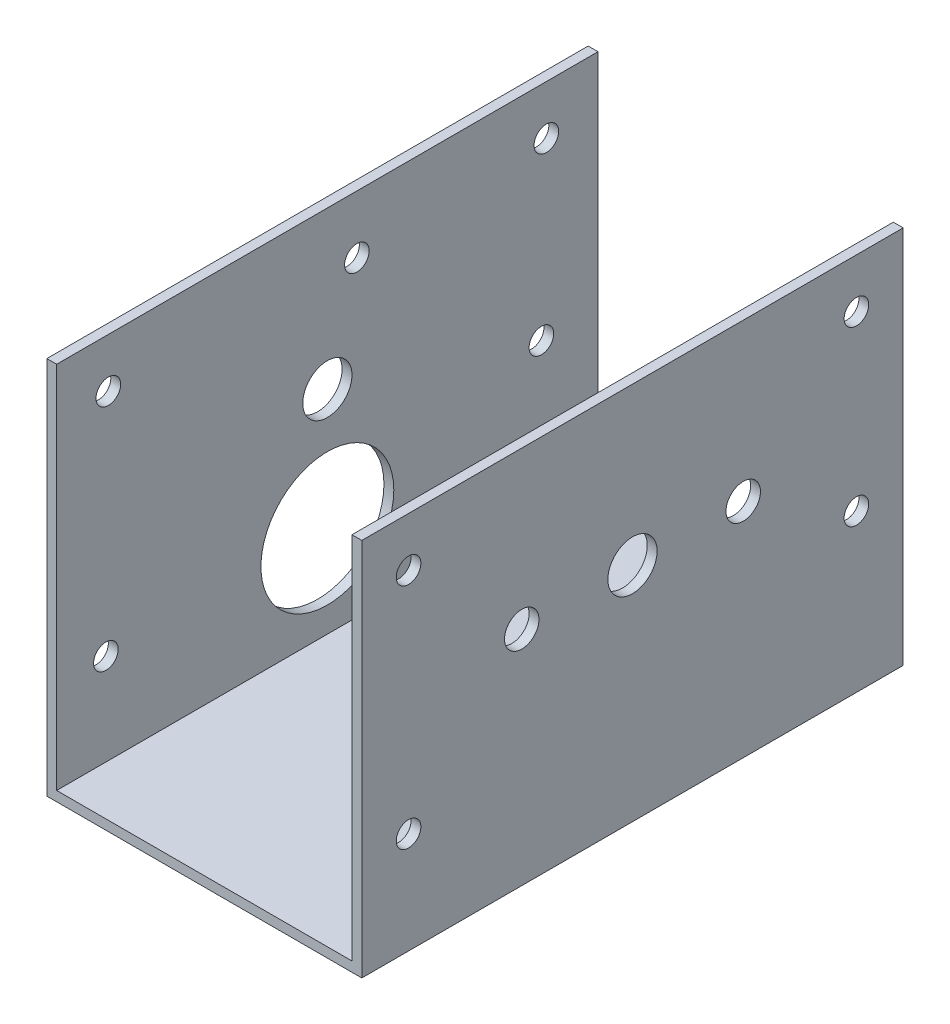
ISO-10303-21;
HEADER;
FILE_DESCRIPTION(('STEP AP214'),'2;1');
FILE_NAME('part.step','',(''),(''),'','','');
FILE_SCHEMA(('AUTOMOTIVE_DESIGN { 1 0 10303 214 1 1 1 1 }'));
ENDSEC;
DATA;
#1=APPLICATION_CONTEXT('core data for automotive mechanical design processes');
#2=APPLICATION_PROTOCOL_DEFINITION('international standard','automotive_design',2000,#1);
#3=PRODUCT_CONTEXT('',#1,'mechanical');
#4=PRODUCT('Part','Part','',(#3));
#5=PRODUCT_RELATED_PRODUCT_CATEGORY('part','',(#4));
#6=PRODUCT_DEFINITION_FORMATION('','',#4);
#7=PRODUCT_DEFINITION_CONTEXT('part definition',#1,'design');
#8=PRODUCT_DEFINITION('design','',#6,#7);
#9=PRODUCT_DEFINITION_SHAPE('','',#8);
#10=(LENGTH_UNIT() NAMED_UNIT(*) SI_UNIT(.MILLI.,.METRE.));
#11=(NAMED_UNIT(*) PLANE_ANGLE_UNIT() SI_UNIT($,.RADIAN.));
#12=(NAMED_UNIT(*) SI_UNIT($,.STERADIAN.) SOLID_ANGLE_UNIT());
#13=UNCERTAINTY_MEASURE_WITH_UNIT(LENGTH_MEASURE(1.E-05),#10,'distance_accuracy_value','');
#14=(GEOMETRIC_REPRESENTATION_CONTEXT(3) GLOBAL_UNCERTAINTY_ASSIGNED_CONTEXT((#13)) GLOBAL_UNIT_ASSIGNED_CONTEXT((#10,
#11,#12)) REPRESENTATION_CONTEXT('',''));
#15=CARTESIAN_POINT('',(0.,0.,0.));
#16=DIRECTION('',(0.,0.,1.));
#17=DIRECTION('',(1.,0.,0.));
#18=AXIS2_PLACEMENT_3D('',#15,#16,#17);
#19=CARTESIAN_POINT('',(0.,0.,0.));
#20=DIRECTION('',(0.,1.,0.));
#21=DIRECTION('',(0.,0.,1.));
#22=AXIS2_PLACEMENT_3D('',#19,#20,#21);
#23=PLANE('',#22);
#24=CARTESIAN_POINT('',(-8.83883476483183,0.,8.83883476483175));
#25=DIRECTION('',(0.,1.,0.));
#26=DIRECTION('',(0.,0.,1.));
#27=AXIS2_PLACEMENT_3D('',#24,#25,#26);
#28=CIRCLE('',#27,2.5);
#29=CARTESIAN_POINT('',(-8.83883476483183,0.,11.3388347648318));
#30=VERTEX_POINT('',#29);
#31=EDGE_CURVE('E303',#30,#30,#28,.T.);
#32=ORIENTED_EDGE('',*,*,#31,.T.);
#33=EDGE_LOOP('',(#32));
#34=FACE_BOUND('',#33,.T.);
#35=CARTESIAN_POINT('',(8.83883476483183,0.,-8.83883476483197));
#36=DIRECTION('',(0.,1.,0.));
#37=DIRECTION('',(0.,0.,1.));
#38=AXIS2_PLACEMENT_3D('',#35,#36,#37);
#39=CIRCLE('',#38,2.5);
#40=CARTESIAN_POINT('',(8.83883476483183,0.,-6.33883476483197));
#41=VERTEX_POINT('',#40);
#42=EDGE_CURVE('E307',#41,#41,#39,.T.);
#43=ORIENTED_EDGE('',*,*,#42,.T.);
#44=EDGE_LOOP('',(#43));
#45=FACE_BOUND('',#44,.T.);
#46=CARTESIAN_POINT('',(8.83883476483183,0.,8.83883476483175));
#47=DIRECTION('',(0.,1.,0.));
#48=DIRECTION('',(0.,0.,1.));
#49=AXIS2_PLACEMENT_3D('',#46,#47,#48);
#50=CIRCLE('',#49,2.5);
#51=CARTESIAN_POINT('',(8.83883476483183,0.,11.3388347648318));
#52=VERTEX_POINT('',#51);
#53=EDGE_CURVE('E311',#52,#52,#50,.T.);
#54=ORIENTED_EDGE('',*,*,#53,.T.);
#55=EDGE_LOOP('',(#54));
#56=FACE_BOUND('',#55,.T.);
#57=CARTESIAN_POINT('',(-8.83883476483183,0.,-8.83883476483197));
#58=DIRECTION('',(0.,1.,0.));
#59=DIRECTION('',(0.,0.,1.));
#60=AXIS2_PLACEMENT_3D('',#57,#58,#59);
#61=CIRCLE('',#60,2.5);
#62=CARTESIAN_POINT('',(-8.83883476483183,0.,-6.33883476483197));
#63=VERTEX_POINT('',#62);
#64=EDGE_CURVE('E315',#63,#63,#61,.T.);
#65=ORIENTED_EDGE('',*,*,#64,.T.);
#66=EDGE_LOOP('',(#65));
#67=FACE_BOUND('',#66,.T.);
#68=DIRECTION('',(-1.,0.,0.));
#69=VECTOR('',#68,1.);
#70=CARTESIAN_POINT('',(0.,0.,55.));
#71=LINE('',#70,#69);
#72=CARTESIAN_POINT('',(32.,0.,55.));
#73=VERTEX_POINT('',#72);
#74=CARTESIAN_POINT('',(-32.,0.,55.));
#75=VERTEX_POINT('',#74);
#76=EDGE_CURVE('E241',#73,#75,#71,.T.);
#77=ORIENTED_EDGE('',*,*,#76,.T.);
#78=DIRECTION('',(0.,0.,1.));
#79=VECTOR('',#78,1.);
#80=CARTESIAN_POINT('',(-32.,0.,-55.));
#81=LINE('',#80,#79);
#82=CARTESIAN_POINT('',(-32.,0.,-55.));
#83=VERTEX_POINT('',#82);
#84=EDGE_CURVE('E214',#83,#75,#81,.T.);
#85=ORIENTED_EDGE('',*,*,#84,.F.);
#86=DIRECTION('',(-1.,0.,0.));
#87=VECTOR('',#86,1.);
#88=CARTESIAN_POINT('',(0.,0.,-55.));
#89=LINE('',#88,#87);
#90=CARTESIAN_POINT('',(32.,0.,-55.));
#91=VERTEX_POINT('',#90);
#92=EDGE_CURVE('E245',#91,#83,#89,.T.);
#93=ORIENTED_EDGE('',*,*,#92,.F.);
#94=DIRECTION('',(0.,0.,1.));
#95=VECTOR('',#94,1.);
#96=CARTESIAN_POINT('',(32.,0.,-55.));
#97=LINE('',#96,#95);
#98=EDGE_CURVE('E185',#91,#73,#97,.T.);
#99=ORIENTED_EDGE('',*,*,#98,.T.);
#100=EDGE_LOOP('',(#77,#85,#93,#99));
#101=FACE_BOUND('',#100,.T.);
#102=ADVANCED_FACE('F97',(#34,#45,#56,#67,#101),#23,.F.);
#103=CARTESIAN_POINT('',(0.,2.,55.));
#104=DIRECTION('',(0.,0.,1.));
#105=DIRECTION('',(1.,0.,0.));
#106=AXIS2_PLACEMENT_3D('',#103,#104,#105);
#107=PLANE('',#106);
#108=ORIENTED_EDGE('',*,*,#76,.F.);
#109=DIRECTION('',(0.,1.,0.));
#110=VECTOR('',#109,1.);
#111=CARTESIAN_POINT('',(32.,0.,55.));
#112=LINE('',#111,#110);
#113=CARTESIAN_POINT('',(32.,77.,55.));
#114=VERTEX_POINT('',#113);
#115=EDGE_CURVE('E192',#73,#114,#112,.T.);
#116=ORIENTED_EDGE('',*,*,#115,.T.);
#117=DIRECTION('',(-1.,0.,0.));
#118=VECTOR('',#117,1.);
#119=CARTESIAN_POINT('',(32.,77.,55.));
#120=LINE('',#119,#118);
#121=CARTESIAN_POINT('',(30.,77.,55.));
#122=VERTEX_POINT('',#121);
#123=EDGE_CURVE('E176',#114,#122,#120,.T.);
#124=ORIENTED_EDGE('',*,*,#123,.T.);
#125=DIRECTION('',(0.,1.,0.));
#126=VECTOR('',#125,1.);
#127=CARTESIAN_POINT('',(30.,0.,55.));
#128=LINE('',#127,#126);
#129=CARTESIAN_POINT('',(30.,2.,55.));
#130=VERTEX_POINT('',#129);
#131=EDGE_CURVE('E187',#130,#122,#128,.T.);
#132=ORIENTED_EDGE('',*,*,#131,.F.);
#133=DIRECTION('',(-1.,0.,0.));
#134=VECTOR('',#133,1.);
#135=CARTESIAN_POINT('',(0.,2.,55.));
#136=LINE('',#135,#134);
#137=CARTESIAN_POINT('',(-30.,2.,55.));
#138=VERTEX_POINT('',#137);
#139=EDGE_CURVE('E244',#130,#138,#136,.T.);
#140=ORIENTED_EDGE('',*,*,#139,.T.);
#141=DIRECTION('',(0.,1.,0.));
#142=VECTOR('',#141,1.);
#143=CARTESIAN_POINT('',(-30.,0.,55.));
#144=LINE('',#143,#142);
#145=CARTESIAN_POINT('',(-30.,77.,55.));
#146=VERTEX_POINT('',#145);
#147=EDGE_CURVE('E229',#138,#146,#144,.T.);
#148=ORIENTED_EDGE('',*,*,#147,.T.);
#149=DIRECTION('',(1.,0.,0.));
#150=VECTOR('',#149,1.);
#151=CARTESIAN_POINT('',(-32.,77.,55.));
#152=LINE('',#151,#150);
#153=CARTESIAN_POINT('',(-32.,77.,55.));
#154=VERTEX_POINT('',#153);
#155=EDGE_CURVE('E237',#154,#146,#152,.T.);
#156=ORIENTED_EDGE('',*,*,#155,.F.);
#157=DIRECTION('',(0.,1.,0.));
#158=VECTOR('',#157,1.);
#159=CARTESIAN_POINT('',(-32.,0.,55.));
#160=LINE('',#159,#158);
#161=EDGE_CURVE('E219',#75,#154,#160,.T.);
#162=ORIENTED_EDGE('',*,*,#161,.F.);
#163=EDGE_LOOP('',(#108,#116,#124,#132,#140,#148,#156,#162));
#164=FACE_BOUND('',#163,.T.);
#165=ADVANCED_FACE('F99',(#164),#107,.T.);
#166=CARTESIAN_POINT('',(0.,2.,-55.));
#167=DIRECTION('',(0.,0.,1.));
#168=DIRECTION('',(1.,0.,0.));
#169=AXIS2_PLACEMENT_3D('',#166,#167,#168);
#170=PLANE('',#169);
#171=ORIENTED_EDGE('',*,*,#92,.T.);
#172=DIRECTION('',(0.,-1.,0.));
#173=VECTOR('',#172,1.);
#174=CARTESIAN_POINT('',(-32.,0.,-55.));
#175=LINE('',#174,#173);
#176=CARTESIAN_POINT('',(-32.,77.,-55.));
#177=VERTEX_POINT('',#176);
#178=EDGE_CURVE('E210',#177,#83,#175,.T.);
#179=ORIENTED_EDGE('',*,*,#178,.F.);
#180=DIRECTION('',(1.,0.,0.));
#181=VECTOR('',#180,1.);
#182=CARTESIAN_POINT('',(-32.,77.,-55.));
#183=LINE('',#182,#181);
#184=CARTESIAN_POINT('',(-30.,77.,-55.));
#185=VERTEX_POINT('',#184);
#186=EDGE_CURVE('E225',#177,#185,#183,.T.);
#187=ORIENTED_EDGE('',*,*,#186,.T.);
#188=DIRECTION('',(0.,-1.,0.));
#189=VECTOR('',#188,1.);
#190=CARTESIAN_POINT('',(-30.,0.,-55.));
#191=LINE('',#190,#189);
#192=CARTESIAN_POINT('',(-30.,2.,-55.));
#193=VERTEX_POINT('',#192);
#194=EDGE_CURVE('E175',#185,#193,#191,.T.);
#195=ORIENTED_EDGE('',*,*,#194,.T.);
#196=DIRECTION('',(-1.,0.,0.));
#197=VECTOR('',#196,1.);
#198=CARTESIAN_POINT('',(0.,2.,-55.));
#199=LINE('',#198,#197);
#200=CARTESIAN_POINT('',(30.,2.,-55.));
#201=VERTEX_POINT('',#200);
#202=EDGE_CURVE('E12',#201,#193,#199,.T.);
#203=ORIENTED_EDGE('',*,*,#202,.F.);
#204=DIRECTION('',(0.,-1.,0.));
#205=VECTOR('',#204,1.);
#206=CARTESIAN_POINT('',(30.,0.,-55.));
#207=LINE('',#206,#205);
#208=CARTESIAN_POINT('',(30.,77.,-55.));
#209=VERTEX_POINT('',#208);
#210=EDGE_CURVE('E115',#209,#201,#207,.T.);
#211=ORIENTED_EDGE('',*,*,#210,.F.);
#212=DIRECTION('',(-1.,0.,0.));
#213=VECTOR('',#212,1.);
#214=CARTESIAN_POINT('',(32.,77.,-55.));
#215=LINE('',#214,#213);
#216=CARTESIAN_POINT('',(32.,77.,-55.));
#217=VERTEX_POINT('',#216);
#218=EDGE_CURVE('E165',#217,#209,#215,.T.);
#219=ORIENTED_EDGE('',*,*,#218,.F.);
#220=DIRECTION('',(0.,-1.,0.));
#221=VECTOR('',#220,1.);
#222=CARTESIAN_POINT('',(32.,0.,-55.));
#223=LINE('',#222,#221);
#224=EDGE_CURVE('E168',#217,#91,#223,.T.);
#225=ORIENTED_EDGE('',*,*,#224,.T.);
#226=EDGE_LOOP('',(#171,#179,#187,#195,#203,#211,#219,#225));
#227=FACE_BOUND('',#226,.T.);
#228=ADVANCED_FACE('F167',(#227),#170,.F.);
#229=CARTESIAN_POINT('',(0.,2.,0.));
#230=DIRECTION('',(0.,1.,0.));
#231=DIRECTION('',(0.,0.,1.));
#232=AXIS2_PLACEMENT_3D('',#229,#230,#231);
#233=PLANE('',#232);
#234=CARTESIAN_POINT('',(-8.83883476483183,2.,8.83883476483175));
#235=DIRECTION('',(0.,1.,0.));
#236=DIRECTION('',(0.,0.,1.));
#237=AXIS2_PLACEMENT_3D('',#234,#235,#236);
#238=CIRCLE('',#237,2.5);
#239=CARTESIAN_POINT('',(-8.83883476483183,2.,11.3388347648318));
#240=VERTEX_POINT('',#239);
#241=EDGE_CURVE('E323',#240,#240,#238,.T.);
#242=ORIENTED_EDGE('',*,*,#241,.F.);
#243=EDGE_LOOP('',(#242));
#244=FACE_BOUND('',#243,.T.);
#245=CARTESIAN_POINT('',(8.83883476483183,2.,-8.83883476483197));
#246=DIRECTION('',(0.,1.,0.));
#247=DIRECTION('',(0.,0.,1.));
#248=AXIS2_PLACEMENT_3D('',#245,#246,#247);
#249=CIRCLE('',#248,2.5);
#250=CARTESIAN_POINT('',(8.83883476483183,2.,-6.33883476483197));
#251=VERTEX_POINT('',#250);
#252=EDGE_CURVE('E324',#251,#251,#249,.T.);
#253=ORIENTED_EDGE('',*,*,#252,.F.);
#254=EDGE_LOOP('',(#253));
#255=FACE_BOUND('',#254,.T.);
#256=CARTESIAN_POINT('',(8.83883476483183,2.,8.83883476483175));
#257=DIRECTION('',(0.,1.,0.));
#258=DIRECTION('',(0.,0.,1.));
#259=AXIS2_PLACEMENT_3D('',#256,#257,#258);
#260=CIRCLE('',#259,2.5);
#261=CARTESIAN_POINT('',(8.83883476483183,2.,11.3388347648318));
#262=VERTEX_POINT('',#261);
#263=EDGE_CURVE('E328',#262,#262,#260,.T.);
#264=ORIENTED_EDGE('',*,*,#263,.F.);
#265=EDGE_LOOP('',(#264));
#266=FACE_BOUND('',#265,.T.);
#267=CARTESIAN_POINT('',(-8.83883476483183,2.,-8.83883476483197));
#268=DIRECTION('',(0.,1.,0.));
#269=DIRECTION('',(0.,0.,1.));
#270=AXIS2_PLACEMENT_3D('',#267,#268,#269);
#271=CIRCLE('',#270,2.5);
#272=CARTESIAN_POINT('',(-8.83883476483183,2.,-6.33883476483197));
#273=VERTEX_POINT('',#272);
#274=EDGE_CURVE('E319',#273,#273,#271,.T.);
#275=ORIENTED_EDGE('',*,*,#274,.F.);
#276=EDGE_LOOP('',(#275));
#277=FACE_BOUND('',#276,.T.);
#278=DIRECTION('',(0.,0.,-1.));
#279=VECTOR('',#278,1.);
#280=CARTESIAN_POINT('',(-30.,2.,0.));
#281=LINE('',#280,#279);
#282=EDGE_CURVE('E122',#138,#193,#281,.T.);
#283=ORIENTED_EDGE('',*,*,#282,.F.);
#284=ORIENTED_EDGE('',*,*,#139,.F.);
#285=DIRECTION('',(0.,0.,-1.));
#286=VECTOR('',#285,1.);
#287=CARTESIAN_POINT('',(30.,2.,0.));
#288=LINE('',#287,#286);
#289=EDGE_CURVE('E107',#130,#201,#288,.T.);
#290=ORIENTED_EDGE('',*,*,#289,.T.);
#291=ORIENTED_EDGE('',*,*,#202,.T.);
#292=EDGE_LOOP('',(#283,#284,#290,#291));
#293=FACE_BOUND('',#292,.T.);
#294=ADVANCED_FACE('F441',(#244,#255,#266,#277,#293),#233,.T.);
#295=CARTESIAN_POINT('',(-32.,77.,-55.));
#296=DIRECTION('',(0.,-1.,0.));
#297=DIRECTION('',(0.,0.,-1.));
#298=AXIS2_PLACEMENT_3D('',#295,#296,#297);
#299=PLANE('',#298);
#300=DIRECTION('',(0.,0.,-1.));
#301=VECTOR('',#300,1.);
#302=CARTESIAN_POINT('',(-30.,77.,-55.));
#303=LINE('',#302,#301);
#304=EDGE_CURVE('E215',#146,#185,#303,.T.);
#305=ORIENTED_EDGE('',*,*,#304,.T.);
#306=ORIENTED_EDGE('',*,*,#186,.F.);
#307=DIRECTION('',(0.,0.,-1.));
#308=VECTOR('',#307,1.);
#309=CARTESIAN_POINT('',(-32.,77.,-55.));
#310=LINE('',#309,#308);
#311=EDGE_CURVE('E222',#154,#177,#310,.T.);
#312=ORIENTED_EDGE('',*,*,#311,.F.);
#313=ORIENTED_EDGE('',*,*,#155,.T.);
#314=EDGE_LOOP('',(#305,#306,#312,#313));
#315=FACE_BOUND('',#314,.T.);
#316=ADVANCED_FACE('F443',(#315),#299,.F.);
#317=CARTESIAN_POINT('',(-32.,0.,0.));
#318=DIRECTION('',(1.,0.,0.));
#319=DIRECTION('',(0.,0.,-1.));
#320=AXIS2_PLACEMENT_3D('',#317,#318,#319);
#321=PLANE('',#320);
#322=CARTESIAN_POINT('',(-32.,67.,-44.5));
#323=DIRECTION('',(-1.,0.,0.));
#324=DIRECTION('',(0.,0.,1.));
#325=AXIS2_PLACEMENT_3D('',#322,#323,#324);
#326=CIRCLE('',#325,2.5);
#327=CARTESIAN_POINT('',(-32.,67.,-42.));
#328=VERTEX_POINT('',#327);
#329=EDGE_CURVE('E348',#328,#328,#326,.T.);
#330=ORIENTED_EDGE('',*,*,#329,.F.);
#331=EDGE_LOOP('',(#330));
#332=FACE_BOUND('',#331,.T.);
#333=CARTESIAN_POINT('',(-32.,67.,44.5));
#334=DIRECTION('',(-1.,0.,0.));
#335=DIRECTION('',(0.,0.,-1.));
#336=AXIS2_PLACEMENT_3D('',#333,#334,#335);
#337=CIRCLE('',#336,2.5);
#338=CARTESIAN_POINT('',(-32.,67.,42.));
#339=VERTEX_POINT('',#338);
#340=EDGE_CURVE('E352',#339,#339,#337,.T.);
#341=ORIENTED_EDGE('',*,*,#340,.F.);
#342=EDGE_LOOP('',(#341));
#343=FACE_BOUND('',#342,.T.);
#344=CARTESIAN_POINT('',(-32.,45.125,0.));
#345=DIRECTION('',(1.,0.,0.));
#346=DIRECTION('',(0.,0.,-1.));
#347=AXIS2_PLACEMENT_3D('',#344,#345,#346);
#348=CIRCLE('',#347,5.);
#349=CARTESIAN_POINT('',(-32.,45.125,-5.));
#350=VERTEX_POINT('',#349);
#351=EDGE_CURVE('E281',#350,#350,#348,.T.);
#352=ORIENTED_EDGE('',*,*,#351,.T.);
#353=EDGE_LOOP('',(#352));
#354=FACE_BOUND('',#353,.T.);
#355=CARTESIAN_POINT('',(-32.,20.625,45.0000000000001));
#356=DIRECTION('',(-1.,0.,0.));
#357=DIRECTION('',(0.,0.,1.));
#358=AXIS2_PLACEMENT_3D('',#355,#356,#357);
#359=CIRCLE('',#358,2.50000000000003);
#360=CARTESIAN_POINT('',(-32.,20.625,47.5000000000001));
#361=VERTEX_POINT('',#360);
#362=EDGE_CURVE('E258',#361,#361,#359,.T.);
#363=ORIENTED_EDGE('',*,*,#362,.F.);
#364=EDGE_LOOP('',(#363));
#365=FACE_BOUND('',#364,.T.);
#366=CARTESIAN_POINT('',(-32.,65.225,-5.99999999999994));
#367=DIRECTION('',(-1.,0.,0.));
#368=DIRECTION('',(0.,0.,1.));
#369=AXIS2_PLACEMENT_3D('',#366,#367,#368);
#370=CIRCLE('',#369,2.50000000000003);
#371=CARTESIAN_POINT('',(-32.,65.225,-3.49999999999991));
#372=VERTEX_POINT('',#371);
#373=EDGE_CURVE('E280',#372,#372,#370,.T.);
#374=ORIENTED_EDGE('',*,*,#373,.F.);
#375=EDGE_LOOP('',(#374));
#376=FACE_BOUND('',#375,.T.);
#377=CARTESIAN_POINT('',(-32.,31.925,-43.4999999999999));
#378=DIRECTION('',(-1.,0.,0.));
#379=DIRECTION('',(0.,0.,1.));
#380=AXIS2_PLACEMENT_3D('',#377,#378,#379);
#381=CIRCLE('',#380,2.50000000000003);
#382=CARTESIAN_POINT('',(-32.,31.925,-40.9999999999999));
#383=VERTEX_POINT('',#382);
#384=EDGE_CURVE('E276',#383,#383,#381,.T.);
#385=ORIENTED_EDGE('',*,*,#384,.F.);
#386=EDGE_LOOP('',(#385));
#387=FACE_BOUND('',#386,.T.);
#388=CARTESIAN_POINT('',(-32.,20.625,0.));
#389=DIRECTION('',(1.,0.,0.));
#390=DIRECTION('',(0.,0.,-1.));
#391=AXIS2_PLACEMENT_3D('',#388,#389,#390);
#392=CIRCLE('',#391,13.4999999999999);
#393=CARTESIAN_POINT('',(-32.,20.625,-13.4999999999999));
#394=VERTEX_POINT('',#393);
#395=EDGE_CURVE('E203',#394,#394,#392,.T.);
#396=ORIENTED_EDGE('',*,*,#395,.T.);
#397=EDGE_LOOP('',(#396));
#398=FACE_BOUND('',#397,.T.);
#399=ORIENTED_EDGE('',*,*,#178,.T.);
#400=ORIENTED_EDGE('',*,*,#84,.T.);
#401=ORIENTED_EDGE('',*,*,#161,.T.);
#402=ORIENTED_EDGE('',*,*,#311,.T.);
#403=EDGE_LOOP('',(#399,#400,#401,#402));
#404=FACE_BOUND('',#403,.T.);
#405=ADVANCED_FACE('F450',(#332,#343,#354,#365,#376,#387,#398,#404),#321,.F.);
#406=CARTESIAN_POINT('',(-30.,0.,0.));
#407=DIRECTION('',(1.,0.,0.));
#408=DIRECTION('',(0.,0.,-1.));
#409=AXIS2_PLACEMENT_3D('',#406,#407,#408);
#410=PLANE('',#409);
#411=CARTESIAN_POINT('',(-30.,67.,-44.5));
#412=DIRECTION('',(1.,0.,0.));
#413=DIRECTION('',(0.,0.,-1.));
#414=AXIS2_PLACEMENT_3D('',#411,#412,#413);
#415=CIRCLE('',#414,2.5);
#416=CARTESIAN_POINT('',(-30.,67.,-47.));
#417=VERTEX_POINT('',#416);
#418=EDGE_CURVE('E356',#417,#417,#415,.F.);
#419=ORIENTED_EDGE('',*,*,#418,.T.);
#420=EDGE_LOOP('',(#419));
#421=FACE_BOUND('',#420,.T.);
#422=CARTESIAN_POINT('',(-30.,67.,44.5));
#423=DIRECTION('',(1.,0.,0.));
#424=DIRECTION('',(0.,0.,-1.));
#425=AXIS2_PLACEMENT_3D('',#422,#423,#424);
#426=CIRCLE('',#425,2.5);
#427=CARTESIAN_POINT('',(-30.,67.,42.));
#428=VERTEX_POINT('',#427);
#429=EDGE_CURVE('E357',#428,#428,#426,.F.);
#430=ORIENTED_EDGE('',*,*,#429,.T.);
#431=EDGE_LOOP('',(#430));
#432=FACE_BOUND('',#431,.T.);
#433=CARTESIAN_POINT('',(-30.,45.125,0.));
#434=DIRECTION('',(1.,0.,0.));
#435=DIRECTION('',(0.,0.,-1.));
#436=AXIS2_PLACEMENT_3D('',#433,#434,#435);
#437=CIRCLE('',#436,5.);
#438=CARTESIAN_POINT('',(-30.,45.125,-5.));
#439=VERTEX_POINT('',#438);
#440=EDGE_CURVE('E291',#439,#439,#437,.T.);
#441=ORIENTED_EDGE('',*,*,#440,.F.);
#442=EDGE_LOOP('',(#441));
#443=FACE_BOUND('',#442,.T.);
#444=CARTESIAN_POINT('',(-30.,20.625,45.0000000000001));
#445=DIRECTION('',(1.,0.,0.));
#446=DIRECTION('',(0.,0.,-1.));
#447=AXIS2_PLACEMENT_3D('',#444,#445,#446);
#448=CIRCLE('',#447,2.50000000000003);
#449=CARTESIAN_POINT('',(-30.,20.625,42.5));
#450=VERTEX_POINT('',#449);
#451=EDGE_CURVE('E101',#450,#450,#448,.T.);
#452=ORIENTED_EDGE('',*,*,#451,.F.);
#453=EDGE_LOOP('',(#452));
#454=FACE_BOUND('',#453,.T.);
#455=CARTESIAN_POINT('',(-30.,65.225,-5.99999999999994));
#456=DIRECTION('',(1.,0.,0.));
#457=DIRECTION('',(0.,0.,-1.));
#458=AXIS2_PLACEMENT_3D('',#455,#456,#457);
#459=CIRCLE('',#458,2.50000000000003);
#460=CARTESIAN_POINT('',(-30.,65.225,-8.49999999999997));
#461=VERTEX_POINT('',#460);
#462=EDGE_CURVE('E257',#461,#461,#459,.T.);
#463=ORIENTED_EDGE('',*,*,#462,.F.);
#464=EDGE_LOOP('',(#463));
#465=FACE_BOUND('',#464,.T.);
#466=CARTESIAN_POINT('',(-30.,31.925,-43.4999999999999));
#467=DIRECTION('',(1.,0.,0.));
#468=DIRECTION('',(0.,0.,-1.));
#469=AXIS2_PLACEMENT_3D('',#466,#467,#468);
#470=CIRCLE('',#469,2.50000000000003);
#471=CARTESIAN_POINT('',(-30.,31.925,-46.));
#472=VERTEX_POINT('',#471);
#473=EDGE_CURVE('E254',#472,#472,#470,.T.);
#474=ORIENTED_EDGE('',*,*,#473,.F.);
#475=EDGE_LOOP('',(#474));
#476=FACE_BOUND('',#475,.T.);
#477=CARTESIAN_POINT('',(-30.,20.625,0.));
#478=DIRECTION('',(1.,0.,0.));
#479=DIRECTION('',(0.,0.,-1.));
#480=AXIS2_PLACEMENT_3D('',#477,#478,#479);
#481=CIRCLE('',#480,13.4999999999999);
#482=CARTESIAN_POINT('',(-30.,20.625,-13.4999999999999));
#483=VERTEX_POINT('',#482);
#484=EDGE_CURVE('E265',#483,#483,#481,.T.);
#485=ORIENTED_EDGE('',*,*,#484,.F.);
#486=EDGE_LOOP('',(#485));
#487=FACE_BOUND('',#486,.T.);
#488=ORIENTED_EDGE('',*,*,#147,.F.);
#489=ORIENTED_EDGE('',*,*,#282,.T.);
#490=ORIENTED_EDGE('',*,*,#194,.F.);
#491=ORIENTED_EDGE('',*,*,#304,.F.);
#492=EDGE_LOOP('',(#488,#489,#490,#491));
#493=FACE_BOUND('',#492,.T.);
#494=ADVANCED_FACE('F481',(#421,#432,#443,#454,#465,#476,#487,#493),#410,.T.);
#495=CARTESIAN_POINT('',(30.,0.,0.));
#496=DIRECTION('',(-1.,0.,0.));
#497=DIRECTION('',(0.,0.,-1.));
#498=AXIS2_PLACEMENT_3D('',#495,#496,#497);
#499=PLANE('',#498);
#500=CARTESIAN_POINT('',(30.,67.,-45.5));
#501=DIRECTION('',(-1.,0.,0.));
#502=DIRECTION('',(0.,0.,1.));
#503=AXIS2_PLACEMENT_3D('',#500,#501,#502);
#504=CIRCLE('',#503,2.5);
#505=CARTESIAN_POINT('',(30.,67.,-43.));
#506=VERTEX_POINT('',#505);
#507=EDGE_CURVE('E388',#506,#506,#504,.F.);
#508=ORIENTED_EDGE('',*,*,#507,.T.);
#509=EDGE_LOOP('',(#508));
#510=FACE_BOUND('',#509,.T.);
#511=CARTESIAN_POINT('',(30.,67.,45.5));
#512=DIRECTION('',(-1.,0.,0.));
#513=DIRECTION('',(0.,0.,1.));
#514=AXIS2_PLACEMENT_3D('',#511,#512,#513);
#515=CIRCLE('',#514,2.5);
#516=CARTESIAN_POINT('',(30.,67.,48.));
#517=VERTEX_POINT('',#516);
#518=EDGE_CURVE('E389',#517,#517,#515,.F.);
#519=ORIENTED_EDGE('',*,*,#518,.T.);
#520=EDGE_LOOP('',(#519));
#521=FACE_BOUND('',#520,.T.);
#522=CARTESIAN_POINT('',(30.,45.125,22.5));
#523=DIRECTION('',(-1.,0.,0.));
#524=DIRECTION('',(0.,0.,1.));
#525=AXIS2_PLACEMENT_3D('',#522,#523,#524);
#526=CIRCLE('',#525,3.5);
#527=CARTESIAN_POINT('',(30.,45.125,26.));
#528=VERTEX_POINT('',#527);
#529=EDGE_CURVE('E361',#528,#528,#526,.T.);
#530=ORIENTED_EDGE('',*,*,#529,.F.);
#531=EDGE_LOOP('',(#530));
#532=FACE_BOUND('',#531,.T.);
#533=CARTESIAN_POINT('',(30.,45.125,-22.5));
#534=DIRECTION('',(-1.,0.,0.));
#535=DIRECTION('',(0.,0.,1.));
#536=AXIS2_PLACEMENT_3D('',#533,#534,#535);
#537=CIRCLE('',#536,3.5);
#538=CARTESIAN_POINT('',(30.,45.125,-19.));
#539=VERTEX_POINT('',#538);
#540=EDGE_CURVE('E371',#539,#539,#537,.T.);
#541=ORIENTED_EDGE('',*,*,#540,.F.);
#542=EDGE_LOOP('',(#541));
#543=FACE_BOUND('',#542,.T.);
#544=CARTESIAN_POINT('',(30.,31.925,-45.5));
#545=DIRECTION('',(-1.,0.,0.));
#546=DIRECTION('',(0.,0.,1.));
#547=AXIS2_PLACEMENT_3D('',#544,#545,#546);
#548=CIRCLE('',#547,2.50000000000003);
#549=CARTESIAN_POINT('',(30.,31.925,-43.));
#550=VERTEX_POINT('',#549);
#551=EDGE_CURVE('E335',#550,#550,#548,.T.);
#552=ORIENTED_EDGE('',*,*,#551,.F.);
#553=EDGE_LOOP('',(#552));
#554=FACE_BOUND('',#553,.T.);
#555=CARTESIAN_POINT('',(30.,20.625,45.5));
#556=DIRECTION('',(-1.,0.,0.));
#557=DIRECTION('',(0.,0.,1.));
#558=AXIS2_PLACEMENT_3D('',#555,#556,#557);
#559=CIRCLE('',#558,2.50000000000003);
#560=CARTESIAN_POINT('',(30.,20.625,48.));
#561=VERTEX_POINT('',#560);
#562=EDGE_CURVE('E339',#561,#561,#559,.T.);
#563=ORIENTED_EDGE('',*,*,#562,.F.);
#564=EDGE_LOOP('',(#563));
#565=FACE_BOUND('',#564,.T.);
#566=CARTESIAN_POINT('',(30.,45.125,0.));
#567=DIRECTION('',(-1.,0.,0.));
#568=DIRECTION('',(0.,0.,1.));
#569=AXIS2_PLACEMENT_3D('',#566,#567,#568);
#570=CIRCLE('',#569,5.);
#571=CARTESIAN_POINT('',(30.,45.125,5.));
#572=VERTEX_POINT('',#571);
#573=EDGE_CURVE('E295',#572,#572,#570,.T.);
#574=ORIENTED_EDGE('',*,*,#573,.F.);
#575=EDGE_LOOP('',(#574));
#576=FACE_BOUND('',#575,.T.);
#577=ORIENTED_EDGE('',*,*,#289,.F.);
#578=ORIENTED_EDGE('',*,*,#131,.T.);
#579=DIRECTION('',(0.,0.,-1.));
#580=VECTOR('',#579,1.);
#581=CARTESIAN_POINT('',(30.,77.,-55.));
#582=LINE('',#581,#580);
#583=EDGE_CURVE('E202',#122,#209,#582,.T.);
#584=ORIENTED_EDGE('',*,*,#583,.T.);
#585=ORIENTED_EDGE('',*,*,#210,.T.);
#586=EDGE_LOOP('',(#577,#578,#584,#585));
#587=FACE_BOUND('',#586,.T.);
#588=ADVANCED_FACE('F400',(#510,#521,#532,#543,#554,#565,#576,#587),#499,.T.);
#589=CARTESIAN_POINT('',(32.,77.,-55.));
#590=DIRECTION('',(0.,1.,0.));
#591=DIRECTION('',(0.,0.,1.));
#592=AXIS2_PLACEMENT_3D('',#589,#590,#591);
#593=PLANE('',#592);
#594=ORIENTED_EDGE('',*,*,#583,.F.);
#595=ORIENTED_EDGE('',*,*,#123,.F.);
#596=DIRECTION('',(0.,0.,-1.));
#597=VECTOR('',#596,1.);
#598=CARTESIAN_POINT('',(32.,77.,-55.));
#599=LINE('',#598,#597);
#600=EDGE_CURVE('E182',#114,#217,#599,.T.);
#601=ORIENTED_EDGE('',*,*,#600,.T.);
#602=ORIENTED_EDGE('',*,*,#218,.T.);
#603=EDGE_LOOP('',(#594,#595,#601,#602));
#604=FACE_BOUND('',#603,.T.);
#605=ADVANCED_FACE('F189',(#604),#593,.T.);
#606=CARTESIAN_POINT('',(32.,0.,0.));
#607=DIRECTION('',(-1.,0.,0.));
#608=DIRECTION('',(0.,0.,-1.));
#609=AXIS2_PLACEMENT_3D('',#606,#607,#608);
#610=PLANE('',#609);
#611=CARTESIAN_POINT('',(32.,67.,-45.5));
#612=DIRECTION('',(1.,0.,0.));
#613=DIRECTION('',(0.,0.,-1.));
#614=AXIS2_PLACEMENT_3D('',#611,#612,#613);
#615=CIRCLE('',#614,2.5);
#616=CARTESIAN_POINT('',(32.,67.,-48.));
#617=VERTEX_POINT('',#616);
#618=EDGE_CURVE('E380',#617,#617,#615,.T.);
#619=ORIENTED_EDGE('',*,*,#618,.F.);
#620=EDGE_LOOP('',(#619));
#621=FACE_BOUND('',#620,.T.);
#622=CARTESIAN_POINT('',(32.,67.,45.5));
#623=DIRECTION('',(1.,0.,0.));
#624=DIRECTION('',(0.,0.,1.));
#625=AXIS2_PLACEMENT_3D('',#622,#623,#624);
#626=CIRCLE('',#625,2.5);
#627=CARTESIAN_POINT('',(32.,67.,48.));
#628=VERTEX_POINT('',#627);
#629=EDGE_CURVE('E384',#628,#628,#626,.T.);
#630=ORIENTED_EDGE('',*,*,#629,.F.);
#631=EDGE_LOOP('',(#630));
#632=FACE_BOUND('',#631,.T.);
#633=CARTESIAN_POINT('',(32.,45.125,22.5));
#634=DIRECTION('',(1.,0.,0.));
#635=DIRECTION('',(0.,0.,-1.));
#636=AXIS2_PLACEMENT_3D('',#633,#634,#635);
#637=CIRCLE('',#636,3.5);
#638=CARTESIAN_POINT('',(32.,45.125,19.));
#639=VERTEX_POINT('',#638);
#640=EDGE_CURVE('E375',#639,#639,#637,.T.);
#641=ORIENTED_EDGE('',*,*,#640,.F.);
#642=EDGE_LOOP('',(#641));
#643=FACE_BOUND('',#642,.T.);
#644=CARTESIAN_POINT('',(32.,45.125,-22.5));
#645=DIRECTION('',(1.,0.,0.));
#646=DIRECTION('',(0.,0.,-1.));
#647=AXIS2_PLACEMENT_3D('',#644,#645,#646);
#648=CIRCLE('',#647,3.5);
#649=CARTESIAN_POINT('',(32.,45.125,-26.));
#650=VERTEX_POINT('',#649);
#651=EDGE_CURVE('E376',#650,#650,#648,.T.);
#652=ORIENTED_EDGE('',*,*,#651,.F.);
#653=EDGE_LOOP('',(#652));
#654=FACE_BOUND('',#653,.T.);
#655=CARTESIAN_POINT('',(32.,31.925,-45.5));
#656=DIRECTION('',(1.,0.,0.));
#657=DIRECTION('',(0.,0.,-1.));
#658=AXIS2_PLACEMENT_3D('',#655,#656,#657);
#659=CIRCLE('',#658,2.50000000000003);
#660=CARTESIAN_POINT('',(32.,31.925,-48.));
#661=VERTEX_POINT('',#660);
#662=EDGE_CURVE('E343',#661,#661,#659,.T.);
#663=ORIENTED_EDGE('',*,*,#662,.F.);
#664=EDGE_LOOP('',(#663));
#665=FACE_BOUND('',#664,.T.);
#666=CARTESIAN_POINT('',(32.,20.625,45.5));
#667=DIRECTION('',(1.,0.,0.));
#668=DIRECTION('',(0.,0.,-1.));
#669=AXIS2_PLACEMENT_3D('',#666,#667,#668);
#670=CIRCLE('',#669,2.50000000000003);
#671=CARTESIAN_POINT('',(32.,20.625,43.));
#672=VERTEX_POINT('',#671);
#673=EDGE_CURVE('E344',#672,#672,#670,.T.);
#674=ORIENTED_EDGE('',*,*,#673,.F.);
#675=EDGE_LOOP('',(#674));
#676=FACE_BOUND('',#675,.T.);
#677=CARTESIAN_POINT('',(32.,45.125,0.));
#678=DIRECTION('',(-1.,0.,0.));
#679=DIRECTION('',(0.,0.,1.));
#680=AXIS2_PLACEMENT_3D('',#677,#678,#679);
#681=CIRCLE('',#680,5.);
#682=CARTESIAN_POINT('',(32.,45.125,5.));
#683=VERTEX_POINT('',#682);
#684=EDGE_CURVE('E299',#683,#683,#681,.T.);
#685=ORIENTED_EDGE('',*,*,#684,.T.);
#686=EDGE_LOOP('',(#685));
#687=FACE_BOUND('',#686,.T.);
#688=ORIENTED_EDGE('',*,*,#224,.F.);
#689=ORIENTED_EDGE('',*,*,#600,.F.);
#690=ORIENTED_EDGE('',*,*,#115,.F.);
#691=ORIENTED_EDGE('',*,*,#98,.F.);
#692=EDGE_LOOP('',(#688,#689,#690,#691));
#693=FACE_BOUND('',#692,.T.);
#694=ADVANCED_FACE('F180',(#621,#632,#643,#654,#665,#676,#687,#693),#610,.F.);
#695=CARTESIAN_POINT('',(-40.,20.625,0.));
#696=DIRECTION('',(1.,0.,0.));
#697=DIRECTION('',(0.,0.,-1.));
#698=AXIS2_PLACEMENT_3D('',#695,#696,#697);
#699=CYLINDRICAL_SURFACE('',#698,13.4999999999999);
#700=ORIENTED_EDGE('',*,*,#484,.T.);
#701=EDGE_LOOP('',(#700));
#702=FACE_BOUND('',#701,.T.);
#703=ORIENTED_EDGE('',*,*,#395,.F.);
#704=EDGE_LOOP('',(#703));
#705=FACE_BOUND('',#704,.T.);
#706=ADVANCED_FACE('F412',(#702,#705),#699,.F.);
#707=CARTESIAN_POINT('',(-22.,31.925,-43.4999999999999));
#708=DIRECTION('',(-1.,0.,0.));
#709=DIRECTION('',(0.,0.,1.));
#710=AXIS2_PLACEMENT_3D('',#707,#708,#709);
#711=CYLINDRICAL_SURFACE('',#710,2.50000000000003);
#712=ORIENTED_EDGE('',*,*,#473,.T.);
#713=EDGE_LOOP('',(#712));
#714=FACE_BOUND('',#713,.T.);
#715=ORIENTED_EDGE('',*,*,#384,.T.);
#716=EDGE_LOOP('',(#715));
#717=FACE_BOUND('',#716,.T.);
#718=ADVANCED_FACE('F498',(#714,#717),#711,.F.);
#719=CARTESIAN_POINT('',(-22.,65.225,-5.99999999999994));
#720=DIRECTION('',(-1.,0.,0.));
#721=DIRECTION('',(0.,0.,1.));
#722=AXIS2_PLACEMENT_3D('',#719,#720,#721);
#723=CYLINDRICAL_SURFACE('',#722,2.50000000000003);
#724=ORIENTED_EDGE('',*,*,#462,.T.);
#725=EDGE_LOOP('',(#724));
#726=FACE_BOUND('',#725,.T.);
#727=ORIENTED_EDGE('',*,*,#373,.T.);
#728=EDGE_LOOP('',(#727));
#729=FACE_BOUND('',#728,.T.);
#730=ADVANCED_FACE('F438',(#726,#729),#723,.F.);
#731=CARTESIAN_POINT('',(-22.,20.625,45.0000000000001));
#732=DIRECTION('',(-1.,0.,0.));
#733=DIRECTION('',(0.,0.,1.));
#734=AXIS2_PLACEMENT_3D('',#731,#732,#733);
#735=CYLINDRICAL_SURFACE('',#734,2.50000000000003);
#736=ORIENTED_EDGE('',*,*,#451,.T.);
#737=EDGE_LOOP('',(#736));
#738=FACE_BOUND('',#737,.T.);
#739=ORIENTED_EDGE('',*,*,#362,.T.);
#740=EDGE_LOOP('',(#739));
#741=FACE_BOUND('',#740,.T.);
#742=ADVANCED_FACE('F429',(#738,#741),#735,.F.);
#743=CARTESIAN_POINT('',(32.,45.125,0.));
#744=DIRECTION('',(-1.,0.,0.));
#745=DIRECTION('',(0.,0.,1.));
#746=AXIS2_PLACEMENT_3D('',#743,#744,#745);
#747=CYLINDRICAL_SURFACE('',#746,5.);
#748=ORIENTED_EDGE('',*,*,#573,.T.);
#749=EDGE_LOOP('',(#748));
#750=FACE_BOUND('',#749,.T.);
#751=ORIENTED_EDGE('',*,*,#684,.F.);
#752=EDGE_LOOP('',(#751));
#753=FACE_BOUND('',#752,.T.);
#754=ADVANCED_FACE('F426',(#750,#753),#747,.F.);
#755=ORIENTED_EDGE('',*,*,#440,.T.);
#756=EDGE_LOOP('',(#755));
#757=FACE_BOUND('',#756,.T.);
#758=ORIENTED_EDGE('',*,*,#351,.F.);
#759=EDGE_LOOP('',(#758));
#760=FACE_BOUND('',#759,.T.);
#761=ADVANCED_FACE('F428',(#757,#760),#747,.F.);
#762=CARTESIAN_POINT('',(-8.83883476483183,-8.,-8.83883476483197));
#763=DIRECTION('',(0.,1.,0.));
#764=DIRECTION('',(0.,0.,1.));
#765=AXIS2_PLACEMENT_3D('',#762,#763,#764);
#766=CYLINDRICAL_SURFACE('',#765,2.5);
#767=ORIENTED_EDGE('',*,*,#274,.T.);
#768=EDGE_LOOP('',(#767));
#769=FACE_BOUND('',#768,.T.);
#770=ORIENTED_EDGE('',*,*,#64,.F.);
#771=EDGE_LOOP('',(#770));
#772=FACE_BOUND('',#771,.T.);
#773=ADVANCED_FACE('F436',(#769,#772),#766,.F.);
#774=CARTESIAN_POINT('',(8.83883476483183,-8.,8.83883476483175));
#775=DIRECTION('',(0.,1.,0.));
#776=DIRECTION('',(0.,0.,1.));
#777=AXIS2_PLACEMENT_3D('',#774,#775,#776);
#778=CYLINDRICAL_SURFACE('',#777,2.5);
#779=ORIENTED_EDGE('',*,*,#263,.T.);
#780=EDGE_LOOP('',(#779));
#781=FACE_BOUND('',#780,.T.);
#782=ORIENTED_EDGE('',*,*,#53,.F.);
#783=EDGE_LOOP('',(#782));
#784=FACE_BOUND('',#783,.T.);
#785=ADVANCED_FACE('F551',(#781,#784),#778,.F.);
#786=CARTESIAN_POINT('',(8.83883476483183,-8.,-8.83883476483197));
#787=DIRECTION('',(0.,1.,0.));
#788=DIRECTION('',(0.,0.,1.));
#789=AXIS2_PLACEMENT_3D('',#786,#787,#788);
#790=CYLINDRICAL_SURFACE('',#789,2.5);
#791=ORIENTED_EDGE('',*,*,#252,.T.);
#792=EDGE_LOOP('',(#791));
#793=FACE_BOUND('',#792,.T.);
#794=ORIENTED_EDGE('',*,*,#42,.F.);
#795=EDGE_LOOP('',(#794));
#796=FACE_BOUND('',#795,.T.);
#797=ADVANCED_FACE('F560',(#793,#796),#790,.F.);
#798=CARTESIAN_POINT('',(-8.83883476483183,-8.,8.83883476483175));
#799=DIRECTION('',(0.,1.,0.));
#800=DIRECTION('',(0.,0.,1.));
#801=AXIS2_PLACEMENT_3D('',#798,#799,#800);
#802=CYLINDRICAL_SURFACE('',#801,2.5);
#803=ORIENTED_EDGE('',*,*,#241,.T.);
#804=EDGE_LOOP('',(#803));
#805=FACE_BOUND('',#804,.T.);
#806=ORIENTED_EDGE('',*,*,#31,.F.);
#807=EDGE_LOOP('',(#806));
#808=FACE_BOUND('',#807,.T.);
#809=ADVANCED_FACE('F570',(#805,#808),#802,.F.);
#810=CARTESIAN_POINT('',(22.,20.625,45.5));
#811=DIRECTION('',(1.,0.,0.));
#812=DIRECTION('',(0.,0.,-1.));
#813=AXIS2_PLACEMENT_3D('',#810,#811,#812);
#814=CYLINDRICAL_SURFACE('',#813,2.50000000000003);
#815=ORIENTED_EDGE('',*,*,#562,.T.);
#816=EDGE_LOOP('',(#815));
#817=FACE_BOUND('',#816,.T.);
#818=ORIENTED_EDGE('',*,*,#673,.T.);
#819=EDGE_LOOP('',(#818));
#820=FACE_BOUND('',#819,.T.);
#821=ADVANCED_FACE('F580',(#817,#820),#814,.F.);
#822=CARTESIAN_POINT('',(22.,31.925,-45.5));
#823=DIRECTION('',(1.,0.,0.));
#824=DIRECTION('',(0.,0.,-1.));
#825=AXIS2_PLACEMENT_3D('',#822,#823,#824);
#826=CYLINDRICAL_SURFACE('',#825,2.50000000000003);
#827=ORIENTED_EDGE('',*,*,#551,.T.);
#828=EDGE_LOOP('',(#827));
#829=FACE_BOUND('',#828,.T.);
#830=ORIENTED_EDGE('',*,*,#662,.T.);
#831=EDGE_LOOP('',(#830));
#832=FACE_BOUND('',#831,.T.);
#833=ADVANCED_FACE('F590',(#829,#832),#826,.F.);
#834=CARTESIAN_POINT('',(32.001,67.,44.5));
#835=DIRECTION('',(-1.,0.,0.));
#836=DIRECTION('',(0.,0.,1.));
#837=AXIS2_PLACEMENT_3D('',#834,#835,#836);
#838=CYLINDRICAL_SURFACE('',#837,2.5);
#839=ORIENTED_EDGE('',*,*,#429,.F.);
#840=EDGE_LOOP('',(#839));
#841=FACE_BOUND('',#840,.T.);
#842=ORIENTED_EDGE('',*,*,#340,.T.);
#843=EDGE_LOOP('',(#842));
#844=FACE_BOUND('',#843,.T.);
#845=ADVANCED_FACE('F600',(#841,#844),#838,.F.);
#846=CARTESIAN_POINT('',(32.001,67.,-44.5));
#847=DIRECTION('',(-1.,0.,0.));
#848=DIRECTION('',(0.,0.,1.));
#849=AXIS2_PLACEMENT_3D('',#846,#847,#848);
#850=CYLINDRICAL_SURFACE('',#849,2.5);
#851=ORIENTED_EDGE('',*,*,#418,.F.);
#852=EDGE_LOOP('',(#851));
#853=FACE_BOUND('',#852,.T.);
#854=ORIENTED_EDGE('',*,*,#329,.T.);
#855=EDGE_LOOP('',(#854));
#856=FACE_BOUND('',#855,.T.);
#857=ADVANCED_FACE('F620',(#853,#856),#850,.F.);
#858=CARTESIAN_POINT('',(22.,45.125,-22.5));
#859=DIRECTION('',(1.,0.,0.));
#860=DIRECTION('',(0.,0.,-1.));
#861=AXIS2_PLACEMENT_3D('',#858,#859,#860);
#862=CYLINDRICAL_SURFACE('',#861,3.5);
#863=ORIENTED_EDGE('',*,*,#540,.T.);
#864=EDGE_LOOP('',(#863));
#865=FACE_BOUND('',#864,.T.);
#866=ORIENTED_EDGE('',*,*,#651,.T.);
#867=EDGE_LOOP('',(#866));
#868=FACE_BOUND('',#867,.T.);
#869=ADVANCED_FACE('F630',(#865,#868),#862,.F.);
#870=CARTESIAN_POINT('',(22.,45.125,22.5));
#871=DIRECTION('',(1.,0.,0.));
#872=DIRECTION('',(0.,0.,-1.));
#873=AXIS2_PLACEMENT_3D('',#870,#871,#872);
#874=CYLINDRICAL_SURFACE('',#873,3.5);
#875=ORIENTED_EDGE('',*,*,#529,.T.);
#876=EDGE_LOOP('',(#875));
#877=FACE_BOUND('',#876,.T.);
#878=ORIENTED_EDGE('',*,*,#640,.T.);
#879=EDGE_LOOP('',(#878));
#880=FACE_BOUND('',#879,.T.);
#881=ADVANCED_FACE('F640',(#877,#880),#874,.F.);
#882=CARTESIAN_POINT('',(-32.001,67.,45.5));
#883=DIRECTION('',(1.,0.,0.));
#884=DIRECTION('',(0.,0.,-1.));
#885=AXIS2_PLACEMENT_3D('',#882,#883,#884);
#886=CYLINDRICAL_SURFACE('',#885,2.5);
#887=ORIENTED_EDGE('',*,*,#518,.F.);
#888=EDGE_LOOP('',(#887));
#889=FACE_BOUND('',#888,.T.);
#890=ORIENTED_EDGE('',*,*,#629,.T.);
#891=EDGE_LOOP('',(#890));
#892=FACE_BOUND('',#891,.T.);
#893=ADVANCED_FACE('F406',(#889,#892),#886,.F.);
#894=CARTESIAN_POINT('',(-32.001,67.,-45.5));
#895=DIRECTION('',(1.,0.,0.));
#896=DIRECTION('',(0.,0.,-1.));
#897=AXIS2_PLACEMENT_3D('',#894,#895,#896);
#898=CYLINDRICAL_SURFACE('',#897,2.5);
#899=ORIENTED_EDGE('',*,*,#507,.F.);
#900=EDGE_LOOP('',(#899));
#901=FACE_BOUND('',#900,.T.);
#902=ORIENTED_EDGE('',*,*,#618,.T.);
#903=EDGE_LOOP('',(#902));
#904=FACE_BOUND('',#903,.T.);
#905=ADVANCED_FACE('F403',(#901,#904),#898,.F.);
#906=CLOSED_SHELL('',(#102,#165,#228,#294,#316,#405,#494,#588,#605,#694,#706,#718,#730,#742,
#754,#761,#773,#785,#797,#809,#821,#833,#845,#857,#869,#881,#893,#905));
#907=MANIFOLD_SOLID_BREP('B2',#906);
#908=ADVANCED_BREP_SHAPE_REPRESENTATION('',(#18,#907),#14);
#909=SHAPE_DEFINITION_REPRESENTATION(#9,#908);
ENDSEC;
END-ISO-10303-21;
